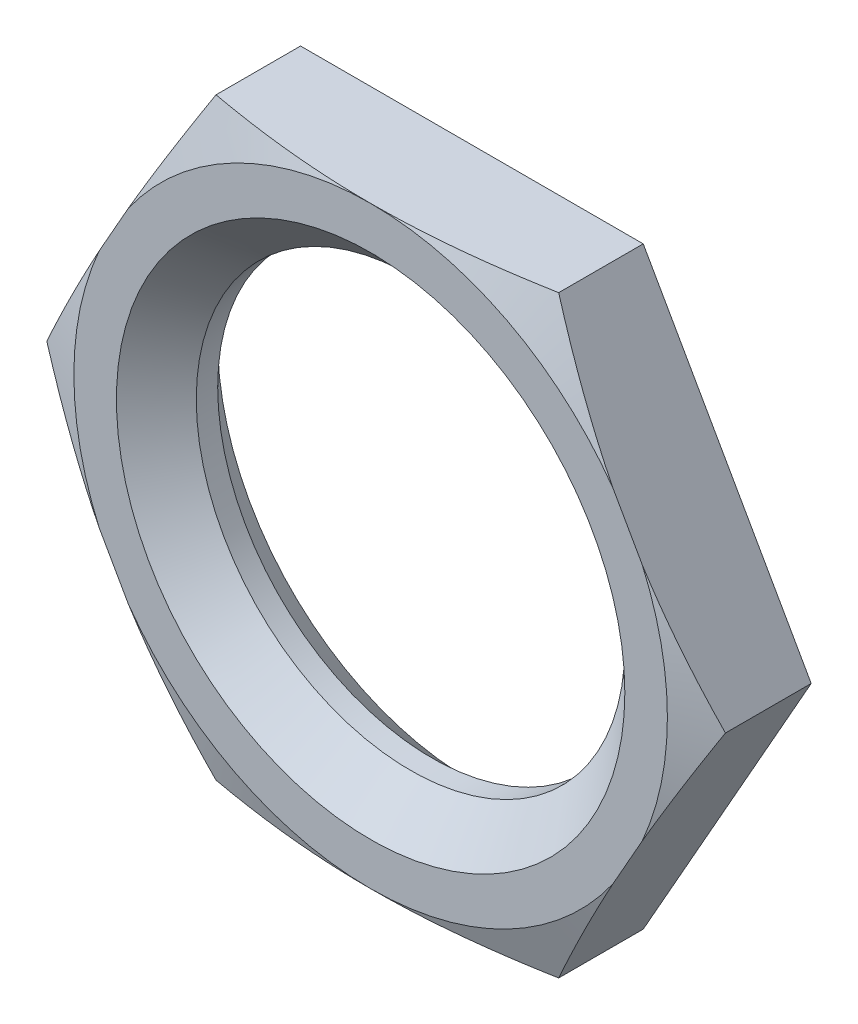
ISO-10303-21;
HEADER;
FILE_DESCRIPTION(('STEP AP214'),'2;1');
FILE_NAME('part.step','',(''),(''),'','','');
FILE_SCHEMA(('AUTOMOTIVE_DESIGN { 1 0 10303 214 1 1 1 1 }'));
ENDSEC;
DATA;
#1=APPLICATION_CONTEXT('core data for automotive mechanical design processes');
#2=APPLICATION_PROTOCOL_DEFINITION('international standard','automotive_design',2000,#1);
#3=PRODUCT_CONTEXT('',#1,'mechanical');
#4=PRODUCT('Part','Part','',(#3));
#5=PRODUCT_RELATED_PRODUCT_CATEGORY('part','',(#4));
#6=PRODUCT_DEFINITION_FORMATION('','',#4);
#7=PRODUCT_DEFINITION_CONTEXT('part definition',#1,'design');
#8=PRODUCT_DEFINITION('design','',#6,#7);
#9=PRODUCT_DEFINITION_SHAPE('','',#8);
#10=(LENGTH_UNIT() NAMED_UNIT(*) SI_UNIT(.MILLI.,.METRE.));
#11=(NAMED_UNIT(*) PLANE_ANGLE_UNIT() SI_UNIT($,.RADIAN.));
#12=(NAMED_UNIT(*) SI_UNIT($,.STERADIAN.) SOLID_ANGLE_UNIT());
#13=UNCERTAINTY_MEASURE_WITH_UNIT(LENGTH_MEASURE(1.E-05),#10,'distance_accuracy_value','');
#14=(GEOMETRIC_REPRESENTATION_CONTEXT(3) GLOBAL_UNCERTAINTY_ASSIGNED_CONTEXT((#13)) GLOBAL_UNIT_ASSIGNED_CONTEXT((#10,
#11,#12)) REPRESENTATION_CONTEXT('',''));
#15=CARTESIAN_POINT('',(0.,0.,0.));
#16=DIRECTION('',(0.,0.,1.));
#17=DIRECTION('',(1.,0.,0.));
#18=AXIS2_PLACEMENT_3D('',#15,#16,#17);
#19=CARTESIAN_POINT('',(0.,8.39724,-1.1938));
#20=DIRECTION('',(0.,0.,1.));
#21=DIRECTION('',(1.,0.,0.));
#22=AXIS2_PLACEMENT_3D('',#19,#20,#21);
#23=PLANE('',#22);
#24=CARTESIAN_POINT('',(0.,0.,-1.1938));
#25=DIRECTION('',(0.,0.,1.));
#26=DIRECTION('',(1.,0.,0.));
#27=AXIS2_PLACEMENT_3D('',#24,#25,#26);
#28=CIRCLE('',#27,5.9944);
#29=CARTESIAN_POINT('',(5.9944,0.,-1.1938));
#30=VERTEX_POINT('',#29);
#31=EDGE_CURVE('E175',#30,#30,#28,.T.);
#32=ORIENTED_EDGE('',*,*,#31,.T.);
#33=EDGE_LOOP('',(#32));
#34=FACE_BOUND('',#33,.T.);
#35=DIRECTION('',(-0.492590096904637,0.870261452916008,0.));
#36=VECTOR('',#35,1.);
#37=CARTESIAN_POINT('',(-9.65934442041346,2.92980560066673,-1.1938));
#38=LINE('',#37,#36);
#39=CARTESIAN_POINT('',(-4.0401239787082,-6.9977,-1.1938));
#40=VERTEX_POINT('',#39);
#41=CARTESIAN_POINT('',(-8.001,0.,-1.1938));
#42=VERTEX_POINT('',#41);
#43=EDGE_CURVE('E42',#40,#42,#38,.T.);
#44=ORIENTED_EDGE('',*,*,#43,.T.);
#45=DIRECTION('',(0.492590096904637,0.870261452916008,0.));
#46=VECTOR('',#45,1.);
#47=CARTESIAN_POINT('',(-2.45985023248309,9.78957773980184,-1.1938));
#48=LINE('',#47,#46);
#49=CARTESIAN_POINT('',(-4.0401239787082,6.9977,-1.1938));
#50=VERTEX_POINT('',#49);
#51=EDGE_CURVE('E11',#42,#50,#48,.T.);
#52=ORIENTED_EDGE('',*,*,#51,.T.);
#53=DIRECTION('',(1.,0.,0.));
#54=VECTOR('',#53,1.);
#55=CARTESIAN_POINT('',(0.,6.9977,-1.1938));
#56=LINE('',#55,#54);
#57=CARTESIAN_POINT('',(4.0401239787082,6.9977,-1.1938));
#58=VERTEX_POINT('',#57);
#59=EDGE_CURVE('E114',#50,#58,#56,.T.);
#60=ORIENTED_EDGE('',*,*,#59,.T.);
#61=DIRECTION('',(0.492590096904637,-0.870261452916008,0.));
#62=VECTOR('',#61,1.);
#63=CARTESIAN_POINT('',(2.45985023248309,9.78957773980184,-1.1938));
#64=LINE('',#63,#62);
#65=CARTESIAN_POINT('',(8.001,0.,-1.1938));
#66=VERTEX_POINT('',#65);
#67=EDGE_CURVE('E118',#58,#66,#64,.T.);
#68=ORIENTED_EDGE('',*,*,#67,.T.);
#69=DIRECTION('',(-0.492590096904637,-0.870261452916008,0.));
#70=VECTOR('',#69,1.);
#71=CARTESIAN_POINT('',(9.65934442041346,2.92980560066673,-1.1938));
#72=LINE('',#71,#70);
#73=CARTESIAN_POINT('',(4.0401239787082,-6.9977,-1.1938));
#74=VERTEX_POINT('',#73);
#75=EDGE_CURVE('E137',#66,#74,#72,.T.);
#76=ORIENTED_EDGE('',*,*,#75,.T.);
#77=DIRECTION('',(-1.,0.,0.));
#78=VECTOR('',#77,1.);
#79=CARTESIAN_POINT('',(0.,-6.9977,-1.1938));
#80=LINE('',#79,#78);
#81=EDGE_CURVE('E133',#74,#40,#80,.T.);
#82=ORIENTED_EDGE('',*,*,#81,.T.);
#83=EDGE_LOOP('',(#44,#52,#60,#68,#76,#82));
#84=FACE_BOUND('',#83,.T.);
#85=ADVANCED_FACE('F34',(#34,#84),#23,.F.);
#86=CARTESIAN_POINT('',(-4.0401239787082,6.9977,2.3876));
#87=DIRECTION('',(0.870261452916008,-0.492590096904637,0.));
#88=DIRECTION('',(0.492590096904637,0.870261452916008,0.));
#89=AXIS2_PLACEMENT_3D('',#86,#87,#88);
#90=PLANE('',#89);
#91=DIRECTION('',(0.,0.,-1.));
#92=VECTOR('',#91,1.);
#93=CARTESIAN_POINT('',(-4.0401239787082,6.9977,2.3876));
#94=LINE('',#93,#92);
#95=CARTESIAN_POINT('',(-4.04012397870823,6.9977,0.799784766334771));
#96=VERTEX_POINT('',#95);
#97=EDGE_CURVE('E49',#96,#50,#94,.T.);
#98=ORIENTED_EDGE('',*,*,#97,.T.);
#99=ORIENTED_EDGE('',*,*,#51,.F.);
#100=DIRECTION('',(0.,0.,-1.));
#101=VECTOR('',#100,1.);
#102=CARTESIAN_POINT('',(-8.001,0.,2.3876));
#103=LINE('',#102,#101);
#104=CARTESIAN_POINT('',(-8.001,0.,0.82862866396072));
#105=VERTEX_POINT('',#104);
#106=EDGE_CURVE('E196',#105,#42,#103,.T.);
#107=ORIENTED_EDGE('',*,*,#106,.F.);
#108=CARTESIAN_POINT('',(-1.3037186274138,11.8321213814872,-0.591848746739535));
#109=CARTESIAN_POINT('',(-1.40466338531494,11.6537817595026,-0.53135656408363));
#110=CARTESIAN_POINT('',(-1.50569517397511,11.4752883798293,-0.471463160661382));
#111=CARTESIAN_POINT('',(-1.70795832769261,11.1179490278374,-0.353064184081212));
#112=CARTESIAN_POINT('',(-1.80918969737085,10.9391030473549,-0.29455864347532));
#113=CARTESIAN_POINT('',(-2.11328198211163,10.4018616468435,-0.121374937183393));
#114=CARTESIAN_POINT('',(-2.31647373561037,10.0428817328511,-0.00907031431873028));
#115=CARTESIAN_POINT('',(-2.72605109391424,9.31927931136751,0.208260491105688));
#116=CARTESIAN_POINT('',(-2.93244800454198,8.95463682982155,0.313199462469798));
#117=CARTESIAN_POINT('',(-3.34658603781928,8.22297704045015,0.511566736184622));
#118=CARTESIAN_POINT('',(-3.55432709053474,7.85595985617765,0.604995632401966));
#119=CARTESIAN_POINT('',(-3.96398110135312,7.13222201230319,0.773410885714152));
#120=CARTESIAN_POINT('',(-4.1658399012386,6.77559703430201,0.848933213706413));
#121=CARTESIAN_POINT('',(-4.5710748837949,6.05966631034327,0.981327931849846));
#122=CARTESIAN_POINT('',(-4.77445099468678,5.70036069119796,1.03820119857615));
#123=CARTESIAN_POINT('',(-5.07993278109211,5.16066445096284,1.10606540736237));
#124=CARTESIAN_POINT('',(-5.18157642437578,4.98109010458525,1.12575172447513));
#125=CARTESIAN_POINT('',(-5.3851062214974,4.62151296718891,1.15894588242107));
#126=CARTESIAN_POINT('',(-5.48699236139948,4.44151020079072,1.17245407007558));
#127=CARTESIAN_POINT('',(-5.69091630313002,4.08123672609043,1.19293757870922));
#128=CARTESIAN_POINT('',(-5.79295409170372,3.90096604120561,1.19991344046484));
#129=CARTESIAN_POINT('',(-5.99708741893258,3.54032264407056,1.20714225246058));
#130=CARTESIAN_POINT('',(-6.09918295713274,3.3599499326242,1.20739525495247));
#131=CARTESIAN_POINT('',(-6.29599478066902,3.01224147364784,1.20139447222335));
#132=CARTESIAN_POINT('',(-6.39071457965748,2.8448995185302,1.19560656091969));
#133=CARTESIAN_POINT('',(-6.58003066675646,2.51043381559703,1.17837639357245));
#134=CARTESIAN_POINT('',(-6.67462694946924,2.3433100773177,1.16693389819946));
#135=CARTESIAN_POINT('',(-6.95812570507759,1.84245137044165,1.12448796214573));
#136=CARTESIAN_POINT('',(-7.14674238316242,1.50922131700419,1.08536592098982));
#137=CARTESIAN_POINT('',(-7.52365831235583,0.843322009997719,0.988335257078691));
#138=CARTESIAN_POINT('',(-7.71195192603743,0.510662716099902,0.930339386996049));
#139=CARTESIAN_POINT('',(-8.08724132258967,-0.152362987339587,0.799255004683489));
#140=CARTESIAN_POINT('',(-8.27423709583033,-0.482729379867918,0.726166380588734));
#141=CARTESIAN_POINT('',(-8.65336985081349,-1.15254516437722,0.565516659240745));
#142=CARTESIAN_POINT('',(-8.845464208145,-1.49191925159248,0.47754641808891));
#143=CARTESIAN_POINT('',(-9.22852328579107,-2.16867169050615,0.292002617469699));
#144=CARTESIAN_POINT('',(-9.41948794762297,-2.50604993888295,0.194428565360407));
#145=CARTESIAN_POINT('',(-9.79873146552542,-3.17606140881037,-0.00710770974171463));
#146=CARTESIAN_POINT('',(-9.98701893266956,-3.5087098435889,-0.111003555889708));
#147=CARTESIAN_POINT('',(-10.2688501275604,-4.00662246238487,-0.270974779406843));
#148=CARTESIAN_POINT('',(-10.3626813307285,-4.17239453070509,-0.324978920105651));
#149=CARTESIAN_POINT('',(-10.550169147457,-4.50363021898923,-0.434209074833027));
#150=CARTESIAN_POINT('',(-10.6438257643353,-4.66909384481514,-0.489435065378169));
#151=CARTESIAN_POINT('',(-10.7374053512944,-4.83442138148716,-0.545194039681704));
#152=B_SPLINE_CURVE_WITH_KNOTS('',3,(#108,#109,#110,#111,#112,#113,#114,#115,#116,#117,#118,
#119,#120,#121,#122,#123,#124,#125,#126,#127,#128,#129,#130,#131,#132,#133,#134,#135,#136,#137,
#138,#139,#140,#141,#142,#143,#144,#145,#146,#147,#148,#149,#150,#151),.UNSPECIFIED.,.F.,.F.,(4,
2,2,2,2,2,2,2,2,2,2,2,2,2,2,2,2,2,2,2,2,4),(0.,0.641003308855448,1.28202163747186,
2.56448608561153,3.86020386979143,5.15585477290437,6.4056192161705,7.65532490744358,
8.2770936416009,8.89882746727437,9.52050981836353,10.1421873375787,10.7192292902208,
11.2962956681679,12.450402285628,13.6099215874383,14.7694494837103,15.9685931823243,
17.1677984249062,18.3560667595874,18.9500418354418,19.5440055052518),.UNSPECIFIED.);
#153=CARTESIAN_POINT('',(-6.40263499073757,2.82383966708149,1.1938));
#154=VERTEX_POINT('',#153);
#155=EDGE_CURVE('E149',#154,#105,#152,.T.);
#156=ORIENTED_EDGE('',*,*,#155,.F.);
#157=DIRECTION('',(-0.492590096904637,-0.870261452916008,0.));
#158=VECTOR('',#157,1.);
#159=CARTESIAN_POINT('',(-6.05959732644828,3.42988606956755,1.1938));
#160=LINE('',#159,#158);
#161=CARTESIAN_POINT('',(-5.71655966215898,4.03593247205362,1.1938));
#162=VERTEX_POINT('',#161);
#163=EDGE_CURVE('E146',#162,#154,#160,.T.);
#164=ORIENTED_EDGE('',*,*,#163,.F.);
#165=EDGE_CURVE('E126',#96,#162,#152,.T.);
#166=ORIENTED_EDGE('',*,*,#165,.F.);
#167=EDGE_LOOP('',(#98,#99,#107,#156,#164,#166));
#168=FACE_BOUND('',#167,.T.);
#169=ADVANCED_FACE('F122',(#168),#90,.F.);
#170=CARTESIAN_POINT('',(-8.001,0.,2.3876));
#171=DIRECTION('',(0.870261452916008,0.492590096904637,0.));
#172=DIRECTION('',(-0.492590096904637,0.870261452916008,0.));
#173=AXIS2_PLACEMENT_3D('',#170,#171,#172);
#174=PLANE('',#173);
#175=ORIENTED_EDGE('',*,*,#106,.T.);
#176=ORIENTED_EDGE('',*,*,#43,.F.);
#177=DIRECTION('',(0.,0.,-1.));
#178=VECTOR('',#177,1.);
#179=CARTESIAN_POINT('',(-4.0401239787082,-6.9977,2.3876));
#180=LINE('',#179,#178);
#181=CARTESIAN_POINT('',(-4.0401239787082,-6.9977,0.799784766334731));
#182=VERTEX_POINT('',#181);
#183=EDGE_CURVE('E194',#182,#40,#180,.T.);
#184=ORIENTED_EDGE('',*,*,#183,.F.);
#185=CARTESIAN_POINT('',(-10.7374053512944,4.83442138148716,-0.545194039681704));
#186=CARTESIAN_POINT('',(-10.6374480293024,4.65782626759235,-0.485635610449754));
#187=CARTESIAN_POINT('',(-10.5374029644708,4.48107613797235,-0.426684331231533));
#188=CARTESIAN_POINT('',(-10.337111849989,4.12722079782149,-0.310188008788266));
#189=CARTESIAN_POINT('',(-10.2368657955033,3.95011557874787,-0.252642999845457));
#190=CARTESIAN_POINT('',(-9.93572595750876,3.41809028105948,-0.0823704558135443));
#191=CARTESIAN_POINT('',(-9.73449944183858,3.06258236282731,0.0279532316964253));
#192=CARTESIAN_POINT('',(-9.32892148311146,2.34604570110691,0.241182146683795));
#193=CARTESIAN_POINT('',(-9.1245589897161,1.98499743492909,0.344001355179305));
#194=CARTESIAN_POINT('',(-8.714496201775,1.26053740241347,0.538039897126236));
#195=CARTESIAN_POINT('',(-8.50879598165309,0.89712576756061,0.629259870189803));
#196=CARTESIAN_POINT('',(-8.10306557009173,0.180319766635345,0.79332334519048));
#197=CARTESIAN_POINT('',(-7.90308809591618,-0.172981463576311,0.866697156993924));
#198=CARTESIAN_POINT('',(-7.50165272705607,-0.882199390512628,0.994806809455336));
#199=CARTESIAN_POINT('',(-7.30019490927662,-1.23811595136866,1.04954361142557));
#200=CARTESIAN_POINT('',(-6.99761747729361,-1.77268105373634,1.11434145753971));
#201=CARTESIAN_POINT('',(-6.89693924271567,-1.95054980759757,1.13303149789113));
#202=CARTESIAN_POINT('',(-6.69535474917001,-2.30669016718005,1.16430254755028));
#203=CARTESIAN_POINT('',(-6.59444850302228,-2.48496175025213,1.17688389213691));
#204=CARTESIAN_POINT('',(-6.39249770529211,-2.8417492613178,1.19561055998983));
#205=CARTESIAN_POINT('',(-6.29145316417773,-3.02026517081742,1.20175634603614));
#206=CARTESIAN_POINT('',(-6.0893189730238,-3.37737668398629,1.20744724076141));
#207=CARTESIAN_POINT('',(-5.98822932323747,-3.5559722872082,1.20699238603701));
#208=CARTESIAN_POINT('',(-5.79142008312431,-3.90367618203769,1.19969100306815));
#209=CARTESIAN_POINT('',(-5.69569741998902,-4.07278990239174,1.19318156983233));
#210=CARTESIAN_POINT('',(-5.50438754731221,-4.41077803654039,1.17441187869781));
#211=CARTESIAN_POINT('',(-5.40880034400402,-4.57965243932252,1.16215136425731));
#212=CARTESIAN_POINT('',(-5.12234657432152,-5.08573178473294,1.11714044569189));
#213=CARTESIAN_POINT('',(-4.93178479610865,-5.42239825655181,1.07616053803107));
#214=CARTESIAN_POINT('',(-4.55100247664977,-6.09512833508841,0.975275268205358));
#215=CARTESIAN_POINT('',(-4.36078784640209,-6.43118149881508,0.915281015991594));
#216=CARTESIAN_POINT('',(-3.98168453637071,-7.10094526277692,0.780185274429952));
#217=CARTESIAN_POINT('',(-3.79279586152307,-7.43465585429153,0.705083728873783));
#218=CARTESIAN_POINT('',(-3.40974111785185,-8.11140063634959,0.540346925601227));
#219=CARTESIAN_POINT('',(-3.21561872640299,-8.4543576618509,0.450298536120221));
#220=CARTESIAN_POINT('',(-2.82850918273495,-9.13826607987866,0.260660755027924));
#221=CARTESIAN_POINT('',(-2.63552208688458,-9.47921737281808,0.161070893844665));
#222=CARTESIAN_POINT('',(-2.25228145235634,-10.1562905692075,-0.0443967154655958));
#223=CARTESIAN_POINT('',(-2.06201916112009,-10.4924279358473,-0.150207582421096));
#224=CARTESIAN_POINT('',(-1.77722280153133,-10.9955791263368,-0.31300547305442));
#225=CARTESIAN_POINT('',(-1.68240249596373,-11.1630986469438,-0.367944286242358));
#226=CARTESIAN_POINT('',(-1.49293550060905,-11.497830960267,-0.479029538958492));
#227=CARTESIAN_POINT('',(-1.39828880763971,-11.6650437586054,-0.535175956106794));
#228=CARTESIAN_POINT('',(-1.3037186274138,-11.8321213814872,-0.591848746739534));
#229=B_SPLINE_CURVE_WITH_KNOTS('',3,(#185,#186,#187,#188,#189,#190,#191,#192,#193,#194,#195,
#196,#197,#198,#199,#200,#201,#202,#203,#204,#205,#206,#207,#208,#209,#210,#211,#212,#213,#214,
#215,#216,#217,#218,#219,#220,#221,#222,#223,#224,#225,#226,#227,#228),.UNSPECIFIED.,.F.,.F.,(4,
2,2,2,2,2,2,2,2,2,2,2,2,2,2,2,2,2,2,2,2,4),(0.,0.634443242607301,1.26890193635587,
2.53825711321435,3.82041151203614,5.10249517882611,6.33982581273893,7.57709261445006,
8.1927301610732,8.80833391429171,9.42389339649788,10.0394494657932,10.622662223508,
11.2059009994028,12.372359987686,13.5443545431876,14.7163534593001,15.9289253689569,
17.1415569845545,18.3429423750248,18.9434787787208,19.5440040625624),.UNSPECIFIED.);
#230=CARTESIAN_POINT('',(-5.71655966215898,-4.03593247205361,1.1938));
#231=VERTEX_POINT('',#230);
#232=EDGE_CURVE('E251',#231,#182,#229,.T.);
#233=ORIENTED_EDGE('',*,*,#232,.F.);
#234=DIRECTION('',(0.492590096904637,-0.870261452916008,0.));
#235=VECTOR('',#234,1.);
#236=CARTESIAN_POINT('',(-6.05959732644828,-3.42988606956755,1.1938));
#237=LINE('',#236,#235);
#238=CARTESIAN_POINT('',(-6.40263499073757,-2.8238396670815,1.1938));
#239=VERTEX_POINT('',#238);
#240=EDGE_CURVE('E158',#239,#231,#237,.T.);
#241=ORIENTED_EDGE('',*,*,#240,.F.);
#242=EDGE_CURVE('E157',#105,#239,#229,.T.);
#243=ORIENTED_EDGE('',*,*,#242,.F.);
#244=EDGE_LOOP('',(#175,#176,#184,#233,#241,#243));
#245=FACE_BOUND('',#244,.T.);
#246=ADVANCED_FACE('F166',(#245),#174,.F.);
#247=CARTESIAN_POINT('',(-4.0401239787082,-6.9977,2.3876));
#248=DIRECTION('',(0.,1.,0.));
#249=DIRECTION('',(0.,0.,1.));
#250=AXIS2_PLACEMENT_3D('',#247,#248,#249);
#251=PLANE('',#250);
#252=ORIENTED_EDGE('',*,*,#183,.T.);
#253=ORIENTED_EDGE('',*,*,#81,.F.);
#254=DIRECTION('',(0.,0.,-1.));
#255=VECTOR('',#254,1.);
#256=CARTESIAN_POINT('',(4.0401239787082,-6.9977,2.3876));
#257=LINE('',#256,#255);
#258=CARTESIAN_POINT('',(4.0401239787082,-6.9977,0.799784766334731));
#259=VERTEX_POINT('',#258);
#260=EDGE_CURVE('E191',#259,#74,#257,.T.);
#261=ORIENTED_EDGE('',*,*,#260,.F.);
#262=CARTESIAN_POINT('',(-10.7078218716367,-6.9977,-0.915010326642584));
#263=CARTESIAN_POINT('',(-10.3911009161172,-6.9977,-0.818539189609649));
#264=CARTESIAN_POINT('',(-10.0740314695785,-6.9977,-0.723191331746901));
#265=CARTESIAN_POINT('',(-9.43901814649866,-6.9977,-0.535363551402579));
#266=CARTESIAN_POINT('',(-9.12107420315141,-6.9977,-0.442883855051296));
#267=CARTESIAN_POINT('',(-8.48359293977712,-6.9977,-0.261260689899761));
#268=CARTESIAN_POINT('',(-8.164053757375,-6.9977,-0.172123734387352));
#269=CARTESIAN_POINT('',(-7.52378826132,-6.9977,0.00177329568066852));
#270=CARTESIAN_POINT('',(-7.20306196901653,-6.9977,0.0865334485442853));
#271=CARTESIAN_POINT('',(-6.5641648829828,-6.9977,0.249583080226079));
#272=CARTESIAN_POINT('',(-6.24601122188613,-6.9977,0.32793935996016));
#273=CARTESIAN_POINT('',(-5.60812198734779,-6.9977,0.4779974014941));
#274=CARTESIAN_POINT('',(-5.28838638741204,-6.9977,0.549699051443058));
#275=CARTESIAN_POINT('',(-4.64725950086119,-6.9977,0.684779831728617));
#276=CARTESIAN_POINT('',(-4.32586880858993,-6.9977,0.748161758900331));
#277=CARTESIAN_POINT('',(-3.68122098788191,-6.9977,0.864676164849298));
#278=CARTESIAN_POINT('',(-3.35796392208751,-6.9977,0.917808985588208));
#279=CARTESIAN_POINT('',(-2.74596063418563,-6.9977,1.00640978097193));
#280=CARTESIAN_POINT('',(-2.45740617892327,-6.9977,1.04319003090771));
#281=CARTESIAN_POINT('',(-1.87907378154689,-6.9977,1.1054870350047));
#282=CARTESIAN_POINT('',(-1.58929587529299,-6.9977,1.13100411701405));
#283=CARTESIAN_POINT('',(-1.0091044976714,-6.9977,1.16954611434048));
#284=CARTESIAN_POINT('',(-0.718691626697289,-6.9977,1.18257992266857));
#285=CARTESIAN_POINT('',(-0.137570478155246,-6.9977,1.19549522696339));
#286=CARTESIAN_POINT('',(0.153137797253476,-6.9977,1.1953768183824));
#287=CARTESIAN_POINT('',(0.735720135031966,-6.9977,1.18196012599631));
#288=CARTESIAN_POINT('',(1.02759263247257,-6.9977,1.16859500225574));
#289=CARTESIAN_POINT('',(1.61048324843488,-6.9977,1.12929975334168));
#290=CARTESIAN_POINT('',(1.90150134622565,-6.9977,1.10336932578051));
#291=CARTESIAN_POINT('',(2.48253860274489,-6.9977,1.0401587959467));
#292=CARTESIAN_POINT('',(2.77255668220848,-6.9977,1.00286891490958));
#293=CARTESIAN_POINT('',(3.35114189987881,-6.9977,0.918455331470847));
#294=CARTESIAN_POINT('',(3.63970903037945,-6.9977,0.871331576897036));
#295=CARTESIAN_POINT('',(4.23109624279693,-6.9977,0.7659826980673));
#296=CARTESIAN_POINT('',(4.53383252752905,-6.9977,0.707291322322115));
#297=CARTESIAN_POINT('',(5.13774676055267,-6.9977,0.582329078476624));
#298=CARTESIAN_POINT('',(5.43892458859408,-6.9977,0.516057634353434));
#299=CARTESIAN_POINT('',(6.03993769894623,-6.9977,0.377333754128046));
#300=CARTESIAN_POINT('',(6.33977256106743,-6.9977,0.304879508771787));
#301=CARTESIAN_POINT('',(6.93817650032606,-6.9977,0.154973400198734));
#302=CARTESIAN_POINT('',(7.23674560787317,-6.9977,0.0775216577800205));
#303=CARTESIAN_POINT('',(7.8331813655467,-6.9977,-0.0815445041134899));
#304=CARTESIAN_POINT('',(8.13104661379691,-6.9977,-0.163164161478948));
#305=CARTESIAN_POINT('',(8.72584680943681,-6.9977,-0.329731729221688));
#306=CARTESIAN_POINT('',(9.02278174300829,-6.9977,-0.414679688784345));
#307=CARTESIAN_POINT('',(9.91229356818082,-6.9977,-0.673559473151436));
#308=CARTESIAN_POINT('',(10.5036864671092,-6.9977,-0.851556771132471));
#309=CARTESIAN_POINT('',(11.6776660799248,-6.9977,-1.21297630875557));
#310=CARTESIAN_POINT('',(12.260278043081,-6.9977,-1.39631720279715));
#311=CARTESIAN_POINT('',(13.4238661256225,-6.9977,-1.76820347819268));
#312=CARTESIAN_POINT('',(14.0048421644276,-6.9977,-1.95674911113905));
#313=CARTESIAN_POINT('',(15.1633290498646,-6.9977,-2.3369154830497));
#314=CARTESIAN_POINT('',(15.7408446596525,-6.9977,-2.52852174217034));
#315=CARTESIAN_POINT('',(16.6063804280772,-6.9977,-2.81805405267359));
#316=CARTESIAN_POINT('',(16.894757755842,-6.9977,-2.91491468082507));
#317=CARTESIAN_POINT('',(17.4713007532099,-6.9977,-3.10926161782266));
#318=CARTESIAN_POINT('',(17.7594664233265,-6.9977,-3.20674792514571));
#319=CARTESIAN_POINT('',(18.04754016785,-6.9977,-3.30450508395375));
#320=B_SPLINE_CURVE_WITH_KNOTS('',3,(#262,#263,#264,#265,#266,#267,#268,#269,#270,#271,#272,
#273,#274,#275,#276,#277,#278,#279,#280,#281,#282,#283,#284,#285,#286,#287,#288,#289,#290,#291,
#292,#293,#294,#295,#296,#297,#298,#299,#300,#301,#302,#303,#304,#305,#306,#307,#308,#309,#310,
#311,#312,#313,#314,#315,#316,#317,#318,#319),.UNSPECIFIED.,.F.,.F.,(4,2,2,2,2,2,2,2,2,2,2,2,2,
2,2,2,2,2,2,2,2,2,2,2,2,2,2,2,4),(0.,0.993269108739945,1.986616330298,2.9818079281676,
3.976981714293,4.95990692200093,5.94284864770763,6.92545908771017,7.90803673722134,
8.78051270253906,9.65296327016377,10.5247918457958,11.3966140941282,12.2728578712726,
13.1491227365244,14.0261440747171,14.9031700659385,15.8281701285378,16.7532405302976,
17.6785825669883,18.6039022449473,19.5304148672248,20.4569411865976,22.309655117059,
24.1419627087728,25.9743590282367,27.7997630594492,28.7123912207313,29.625017161271),.UNSPECIFIED.);
#321=CARTESIAN_POINT('',(0.,-6.9977,1.1938));
#322=VERTEX_POINT('',#321);
#323=EDGE_CURVE('E244',#322,#259,#320,.T.);
#324=ORIENTED_EDGE('',*,*,#323,.F.);
#325=EDGE_CURVE('E250',#182,#322,#320,.T.);
#326=ORIENTED_EDGE('',*,*,#325,.F.);
#327=EDGE_LOOP('',(#252,#253,#261,#324,#326));
#328=FACE_BOUND('',#327,.T.);
#329=ADVANCED_FACE('F227',(#328),#251,.F.);
#330=CARTESIAN_POINT('',(4.0401239787082,-6.9977,2.3876));
#331=DIRECTION('',(-0.870261452916008,0.492590096904637,0.));
#332=DIRECTION('',(-0.492590096904637,-0.870261452916008,0.));
#333=AXIS2_PLACEMENT_3D('',#330,#331,#332);
#334=PLANE('',#333);
#335=ORIENTED_EDGE('',*,*,#260,.T.);
#336=ORIENTED_EDGE('',*,*,#75,.F.);
#337=DIRECTION('',(0.,0.,-1.));
#338=VECTOR('',#337,1.);
#339=CARTESIAN_POINT('',(8.001,0.,2.3876));
#340=LINE('',#339,#338);
#341=CARTESIAN_POINT('',(8.001,0.,0.82862866396072));
#342=VERTEX_POINT('',#341);
#343=EDGE_CURVE('E188',#342,#66,#340,.T.);
#344=ORIENTED_EDGE('',*,*,#343,.F.);
#345=CARTESIAN_POINT('',(1.3037186274138,-11.8321213814872,-0.591848746739535));
#346=CARTESIAN_POINT('',(1.40466338531494,-11.6537817595026,-0.53135656408363));
#347=CARTESIAN_POINT('',(1.50569517397511,-11.4752883798293,-0.471463160661382));
#348=CARTESIAN_POINT('',(1.70795832769261,-11.1179490278374,-0.353064184081212));
#349=CARTESIAN_POINT('',(1.80918969737085,-10.9391030473549,-0.29455864347532));
#350=CARTESIAN_POINT('',(2.11328198211163,-10.4018616468435,-0.121374937183393));
#351=CARTESIAN_POINT('',(2.31647373561037,-10.0428817328511,-0.00907031431873028));
#352=CARTESIAN_POINT('',(2.72605109391424,-9.31927931136751,0.208260491105688));
#353=CARTESIAN_POINT('',(2.93244800454198,-8.95463682982155,0.313199462469798));
#354=CARTESIAN_POINT('',(3.34658603781928,-8.22297704045015,0.511566736184622));
#355=CARTESIAN_POINT('',(3.55432709053474,-7.85595985617765,0.604995632401966));
#356=CARTESIAN_POINT('',(3.96398110135312,-7.13222201230319,0.773410885714152));
#357=CARTESIAN_POINT('',(4.1658399012386,-6.77559703430201,0.848933213706413));
#358=CARTESIAN_POINT('',(4.5710748837949,-6.05966631034327,0.981327931849846));
#359=CARTESIAN_POINT('',(4.77445099468678,-5.70036069119796,1.03820119857615));
#360=CARTESIAN_POINT('',(5.07993278109211,-5.16066445096284,1.10606540736237));
#361=CARTESIAN_POINT('',(5.18157642437578,-4.98109010458525,1.12575172447513));
#362=CARTESIAN_POINT('',(5.3851062214974,-4.62151296718891,1.15894588242107));
#363=CARTESIAN_POINT('',(5.48699236139948,-4.44151020079072,1.17245407007558));
#364=CARTESIAN_POINT('',(5.69091630313002,-4.08123672609043,1.19293757870922));
#365=CARTESIAN_POINT('',(5.79295409170372,-3.90096604120561,1.19991344046484));
#366=CARTESIAN_POINT('',(5.99708741893258,-3.54032264407056,1.20714225246058));
#367=CARTESIAN_POINT('',(6.09918295713274,-3.3599499326242,1.20739525495247));
#368=CARTESIAN_POINT('',(6.29599478066902,-3.01224147364784,1.20139447222335));
#369=CARTESIAN_POINT('',(6.39071457965748,-2.8448995185302,1.19560656091969));
#370=CARTESIAN_POINT('',(6.58003066675646,-2.51043381559703,1.17837639357245));
#371=CARTESIAN_POINT('',(6.67462694946924,-2.3433100773177,1.16693389819946));
#372=CARTESIAN_POINT('',(6.95812570507759,-1.84245137044165,1.12448796214573));
#373=CARTESIAN_POINT('',(7.14674238316242,-1.50922131700419,1.08536592098982));
#374=CARTESIAN_POINT('',(7.52365831235583,-0.843322009997719,0.988335257078691));
#375=CARTESIAN_POINT('',(7.71195192603743,-0.510662716099902,0.930339386996049));
#376=CARTESIAN_POINT('',(8.08724132258967,0.152362987339587,0.799255004683489));
#377=CARTESIAN_POINT('',(8.27423709583033,0.482729379867918,0.726166380588734));
#378=CARTESIAN_POINT('',(8.65336985081349,1.15254516437722,0.565516659240745));
#379=CARTESIAN_POINT('',(8.845464208145,1.49191925159248,0.47754641808891));
#380=CARTESIAN_POINT('',(9.22852328579107,2.16867169050615,0.292002617469699));
#381=CARTESIAN_POINT('',(9.41948794762297,2.50604993888295,0.194428565360407));
#382=CARTESIAN_POINT('',(9.79873146552542,3.17606140881037,-0.00710770974171463));
#383=CARTESIAN_POINT('',(9.98701893266956,3.5087098435889,-0.111003555889708));
#384=CARTESIAN_POINT('',(10.2688501275604,4.00662246238487,-0.270974779406843));
#385=CARTESIAN_POINT('',(10.3626813307285,4.17239453070509,-0.324978920105651));
#386=CARTESIAN_POINT('',(10.550169147457,4.50363021898923,-0.434209074833027));
#387=CARTESIAN_POINT('',(10.6438257643353,4.66909384481514,-0.489435065378169));
#388=CARTESIAN_POINT('',(10.7374053512944,4.83442138148716,-0.545194039681704));
#389=B_SPLINE_CURVE_WITH_KNOTS('',3,(#345,#346,#347,#348,#349,#350,#351,#352,#353,#354,#355,
#356,#357,#358,#359,#360,#361,#362,#363,#364,#365,#366,#367,#368,#369,#370,#371,#372,#373,#374,
#375,#376,#377,#378,#379,#380,#381,#382,#383,#384,#385,#386,#387,#388),.UNSPECIFIED.,.F.,.F.,(4,
2,2,2,2,2,2,2,2,2,2,2,2,2,2,2,2,2,2,2,2,4),(0.,0.641003308855448,1.28202163747186,
2.56448608561153,3.86020386979143,5.15585477290437,6.4056192161705,7.65532490744358,
8.2770936416009,8.89882746727437,9.52050981836353,10.1421873375787,10.7192292902208,
11.2962956681679,12.450402285628,13.6099215874383,14.7694494837103,15.9685931823243,
17.1677984249062,18.3560667595874,18.9500418354418,19.5440055052518),.UNSPECIFIED.);
#390=CARTESIAN_POINT('',(6.40263499073757,-2.82383966708149,1.1938));
#391=VERTEX_POINT('',#390);
#392=EDGE_CURVE('E231',#391,#342,#389,.T.);
#393=ORIENTED_EDGE('',*,*,#392,.F.);
#394=DIRECTION('',(0.492590096904637,0.870261452916008,0.));
#395=VECTOR('',#394,1.);
#396=CARTESIAN_POINT('',(6.05959732644828,-3.42988606956755,1.1938));
#397=LINE('',#396,#395);
#398=CARTESIAN_POINT('',(5.71655966215898,-4.03593247205362,1.1938));
#399=VERTEX_POINT('',#398);
#400=EDGE_CURVE('E238',#399,#391,#397,.T.);
#401=ORIENTED_EDGE('',*,*,#400,.F.);
#402=EDGE_CURVE('E240',#259,#399,#389,.T.);
#403=ORIENTED_EDGE('',*,*,#402,.F.);
#404=EDGE_LOOP('',(#335,#336,#344,#393,#401,#403));
#405=FACE_BOUND('',#404,.T.);
#406=ADVANCED_FACE('F223',(#405),#334,.F.);
#407=CARTESIAN_POINT('',(8.001,0.,2.3876));
#408=DIRECTION('',(-0.870261452916008,-0.492590096904637,0.));
#409=DIRECTION('',(0.492590096904637,-0.870261452916008,0.));
#410=AXIS2_PLACEMENT_3D('',#407,#408,#409);
#411=PLANE('',#410);
#412=ORIENTED_EDGE('',*,*,#343,.T.);
#413=ORIENTED_EDGE('',*,*,#67,.F.);
#414=DIRECTION('',(0.,0.,-1.));
#415=VECTOR('',#414,1.);
#416=CARTESIAN_POINT('',(4.0401239787082,6.9977,2.3876));
#417=LINE('',#416,#415);
#418=CARTESIAN_POINT('',(4.0401239787082,6.9977,0.799784766334731));
#419=VERTEX_POINT('',#418);
#420=EDGE_CURVE('E55',#419,#58,#417,.T.);
#421=ORIENTED_EDGE('',*,*,#420,.F.);
#422=CARTESIAN_POINT('',(10.7374053512944,-4.83442138148716,-0.545194039681704));
#423=CARTESIAN_POINT('',(10.6374480293024,-4.65782626759235,-0.485635610449754));
#424=CARTESIAN_POINT('',(10.5374029644708,-4.48107613797235,-0.426684331231533));
#425=CARTESIAN_POINT('',(10.337111849989,-4.12722079782149,-0.310188008788266));
#426=CARTESIAN_POINT('',(10.2368657955033,-3.95011557874787,-0.252642999845457));
#427=CARTESIAN_POINT('',(9.93572595750876,-3.41809028105948,-0.0823704558135443));
#428=CARTESIAN_POINT('',(9.73449944183858,-3.06258236282731,0.0279532316964253));
#429=CARTESIAN_POINT('',(9.32892148311146,-2.34604570110691,0.241182146683795));
#430=CARTESIAN_POINT('',(9.1245589897161,-1.98499743492909,0.344001355179305));
#431=CARTESIAN_POINT('',(8.714496201775,-1.26053740241347,0.538039897126236));
#432=CARTESIAN_POINT('',(8.50879598165309,-0.89712576756061,0.629259870189803));
#433=CARTESIAN_POINT('',(8.10306557009173,-0.180319766635345,0.79332334519048));
#434=CARTESIAN_POINT('',(7.90308809591618,0.172981463576311,0.866697156993924));
#435=CARTESIAN_POINT('',(7.50165272705607,0.882199390512628,0.994806809455336));
#436=CARTESIAN_POINT('',(7.30019490927662,1.23811595136866,1.04954361142557));
#437=CARTESIAN_POINT('',(6.99761747729361,1.77268105373634,1.11434145753971));
#438=CARTESIAN_POINT('',(6.89693924271567,1.95054980759757,1.13303149789113));
#439=CARTESIAN_POINT('',(6.69535474917001,2.30669016718005,1.16430254755028));
#440=CARTESIAN_POINT('',(6.59444850302228,2.48496175025213,1.17688389213691));
#441=CARTESIAN_POINT('',(6.39249770529211,2.8417492613178,1.19561055998983));
#442=CARTESIAN_POINT('',(6.29145316417773,3.02026517081742,1.20175634603614));
#443=CARTESIAN_POINT('',(6.0893189730238,3.37737668398629,1.20744724076141));
#444=CARTESIAN_POINT('',(5.98822932323747,3.5559722872082,1.20699238603701));
#445=CARTESIAN_POINT('',(5.79142008312431,3.90367618203769,1.19969100306815));
#446=CARTESIAN_POINT('',(5.69569741998902,4.07278990239174,1.19318156983233));
#447=CARTESIAN_POINT('',(5.50438754731221,4.41077803654039,1.17441187869781));
#448=CARTESIAN_POINT('',(5.40880034400402,4.57965243932252,1.16215136425731));
#449=CARTESIAN_POINT('',(5.12234657432152,5.08573178473294,1.11714044569189));
#450=CARTESIAN_POINT('',(4.93178479610865,5.42239825655181,1.07616053803107));
#451=CARTESIAN_POINT('',(4.55100247664977,6.09512833508841,0.975275268205358));
#452=CARTESIAN_POINT('',(4.36078784640209,6.43118149881508,0.915281015991594));
#453=CARTESIAN_POINT('',(3.98168453637071,7.10094526277692,0.780185274429952));
#454=CARTESIAN_POINT('',(3.79279586152307,7.43465585429153,0.705083728873783));
#455=CARTESIAN_POINT('',(3.40974111785185,8.11140063634959,0.540346925601227));
#456=CARTESIAN_POINT('',(3.21561872640299,8.4543576618509,0.450298536120221));
#457=CARTESIAN_POINT('',(2.82850918273495,9.13826607987866,0.260660755027924));
#458=CARTESIAN_POINT('',(2.63552208688458,9.47921737281808,0.161070893844665));
#459=CARTESIAN_POINT('',(2.25228145235634,10.1562905692075,-0.0443967154655958));
#460=CARTESIAN_POINT('',(2.06201916112009,10.4924279358473,-0.150207582421096));
#461=CARTESIAN_POINT('',(1.77722280153133,10.9955791263368,-0.31300547305442));
#462=CARTESIAN_POINT('',(1.68240249596373,11.1630986469438,-0.367944286242358));
#463=CARTESIAN_POINT('',(1.49293550060905,11.497830960267,-0.479029538958492));
#464=CARTESIAN_POINT('',(1.39828880763971,11.6650437586054,-0.535175956106794));
#465=CARTESIAN_POINT('',(1.3037186274138,11.8321213814872,-0.591848746739534));
#466=B_SPLINE_CURVE_WITH_KNOTS('',3,(#422,#423,#424,#425,#426,#427,#428,#429,#430,#431,#432,
#433,#434,#435,#436,#437,#438,#439,#440,#441,#442,#443,#444,#445,#446,#447,#448,#449,#450,#451,
#452,#453,#454,#455,#456,#457,#458,#459,#460,#461,#462,#463,#464,#465),.UNSPECIFIED.,.F.,.F.,(4,
2,2,2,2,2,2,2,2,2,2,2,2,2,2,2,2,2,2,2,2,4),(0.,0.634443242607301,1.26890193635587,
2.53825711321435,3.82041151203614,5.10249517882611,6.33982581273893,7.57709261445006,
8.1927301610732,8.80833391429171,9.42389339649788,10.0394494657932,10.622662223508,
11.2059009994028,12.372359987686,13.5443545431876,14.7163534593001,15.9289253689569,
17.1415569845545,18.3429423750248,18.9434787787208,19.5440040625624),.UNSPECIFIED.);
#467=CARTESIAN_POINT('',(5.71655966215898,4.03593247205361,1.1938));
#468=VERTEX_POINT('',#467);
#469=EDGE_CURVE('E206',#468,#419,#466,.T.);
#470=ORIENTED_EDGE('',*,*,#469,.F.);
#471=DIRECTION('',(-0.492590096904637,0.870261452916008,0.));
#472=VECTOR('',#471,1.);
#473=CARTESIAN_POINT('',(6.05959732644828,3.42988606956755,1.1938));
#474=LINE('',#473,#472);
#475=CARTESIAN_POINT('',(6.40263499073757,2.8238396670815,1.1938));
#476=VERTEX_POINT('',#475);
#477=EDGE_CURVE('E241',#476,#468,#474,.T.);
#478=ORIENTED_EDGE('',*,*,#477,.F.);
#479=EDGE_CURVE('E239',#342,#476,#466,.T.);
#480=ORIENTED_EDGE('',*,*,#479,.F.);
#481=EDGE_LOOP('',(#412,#413,#421,#470,#478,#480));
#482=FACE_BOUND('',#481,.T.);
#483=ADVANCED_FACE('F217',(#482),#411,.F.);
#484=CARTESIAN_POINT('',(4.0401239787082,6.9977,2.3876));
#485=DIRECTION('',(0.,-1.,0.));
#486=DIRECTION('',(0.,0.,-1.));
#487=AXIS2_PLACEMENT_3D('',#484,#485,#486);
#488=PLANE('',#487);
#489=ORIENTED_EDGE('',*,*,#420,.T.);
#490=ORIENTED_EDGE('',*,*,#59,.F.);
#491=ORIENTED_EDGE('',*,*,#97,.F.);
#492=CARTESIAN_POINT('',(-10.7078218716367,6.9977,-0.915010326642583));
#493=CARTESIAN_POINT('',(-10.3911009161172,6.9977,-0.818539189609649));
#494=CARTESIAN_POINT('',(-10.0740314695785,6.9977,-0.723191331746901));
#495=CARTESIAN_POINT('',(-9.43901814649866,6.9977,-0.535363551402578));
#496=CARTESIAN_POINT('',(-9.1210742031514,6.9977,-0.442883855051294));
#497=CARTESIAN_POINT('',(-8.48359293977711,6.9977,-0.261260689899759));
#498=CARTESIAN_POINT('',(-8.164053757375,6.9977,-0.17212373438735));
#499=CARTESIAN_POINT('',(-7.52378826132,6.9977,0.00177329568067082));
#500=CARTESIAN_POINT('',(-7.20306196901652,6.9977,0.0865334485442875));
#501=CARTESIAN_POINT('',(-6.5641648829828,6.9977,0.249583080226081));
#502=CARTESIAN_POINT('',(-6.24601122188612,6.9977,0.327939359960161));
#503=CARTESIAN_POINT('',(-5.60812198734779,6.9977,0.477997401494101));
#504=CARTESIAN_POINT('',(-5.28838638741204,6.9977,0.549699051443059));
#505=CARTESIAN_POINT('',(-4.64725950086119,6.9977,0.684779831728618));
#506=CARTESIAN_POINT('',(-4.32586880858992,6.9977,0.748161758900332));
#507=CARTESIAN_POINT('',(-3.6812209878819,6.9977,0.864676164849298));
#508=CARTESIAN_POINT('',(-3.35796392208751,6.9977,0.917808985588208));
#509=CARTESIAN_POINT('',(-2.74596063418563,6.9977,1.00640978097193));
#510=CARTESIAN_POINT('',(-2.45740617892327,6.9977,1.04319003090771));
#511=CARTESIAN_POINT('',(-1.87907378154689,6.9977,1.1054870350047));
#512=CARTESIAN_POINT('',(-1.58929587529299,6.9977,1.13100411701405));
#513=CARTESIAN_POINT('',(-1.0091044976714,6.9977,1.16954611434048));
#514=CARTESIAN_POINT('',(-0.718691626697289,6.9977,1.18257992266857));
#515=CARTESIAN_POINT('',(-0.137570478155247,6.9977,1.19549522696339));
#516=CARTESIAN_POINT('',(0.153137797253475,6.9977,1.1953768183824));
#517=CARTESIAN_POINT('',(0.735720135031966,6.9977,1.18196012599631));
#518=CARTESIAN_POINT('',(1.02759263247257,6.9977,1.16859500225574));
#519=CARTESIAN_POINT('',(1.61048324843488,6.9977,1.12929975334168));
#520=CARTESIAN_POINT('',(1.90150134622565,6.9977,1.10336932578051));
#521=CARTESIAN_POINT('',(2.48253860274489,6.9977,1.0401587959467));
#522=CARTESIAN_POINT('',(2.77255668220848,6.9977,1.00286891490958));
#523=CARTESIAN_POINT('',(3.35114189987881,6.9977,0.918455331470847));
#524=CARTESIAN_POINT('',(3.63970903037945,6.9977,0.871331576897036));
#525=CARTESIAN_POINT('',(4.23109624279693,6.9977,0.7659826980673));
#526=CARTESIAN_POINT('',(4.53383252752905,6.9977,0.707291322322115));
#527=CARTESIAN_POINT('',(5.13774676055267,6.9977,0.582329078476624));
#528=CARTESIAN_POINT('',(5.43892458859409,6.9977,0.516057634353434));
#529=CARTESIAN_POINT('',(6.03993769894623,6.9977,0.377333754128046));
#530=CARTESIAN_POINT('',(6.33977256106744,6.9977,0.304879508771786));
#531=CARTESIAN_POINT('',(6.93817650032606,6.9977,0.154973400198733));
#532=CARTESIAN_POINT('',(7.23674560787317,6.9977,0.0775216577800187));
#533=CARTESIAN_POINT('',(7.8331813655467,6.9977,-0.0815445041134906));
#534=CARTESIAN_POINT('',(8.13104661379691,6.9977,-0.163164161478948));
#535=CARTESIAN_POINT('',(8.7258468094368,6.9977,-0.329731729221687));
#536=CARTESIAN_POINT('',(9.02278174300829,6.9977,-0.414679688784344));
#537=CARTESIAN_POINT('',(9.91229356818083,6.9977,-0.673559473151437));
#538=CARTESIAN_POINT('',(10.5036864671092,6.9977,-0.851556771132473));
#539=CARTESIAN_POINT('',(11.6776660799248,6.9977,-1.21297630875557));
#540=CARTESIAN_POINT('',(12.260278043081,6.9977,-1.39631720279715));
#541=CARTESIAN_POINT('',(13.4238661256225,6.9977,-1.76820347819268));
#542=CARTESIAN_POINT('',(14.0048421644276,6.9977,-1.95674911113906));
#543=CARTESIAN_POINT('',(15.1633290498646,6.9977,-2.3369154830497));
#544=CARTESIAN_POINT('',(15.7408446596525,6.9977,-2.52852174217034));
#545=CARTESIAN_POINT('',(16.6063804280772,6.9977,-2.81805405267359));
#546=CARTESIAN_POINT('',(16.894757755842,6.9977,-2.91491468082507));
#547=CARTESIAN_POINT('',(17.4713007532099,6.9977,-3.10926161782267));
#548=CARTESIAN_POINT('',(17.7594664233265,6.9977,-3.20674792514571));
#549=CARTESIAN_POINT('',(18.04754016785,6.9977,-3.30450508395375));
#550=B_SPLINE_CURVE_WITH_KNOTS('',3,(#492,#493,#494,#495,#496,#497,#498,#499,#500,#501,#502,
#503,#504,#505,#506,#507,#508,#509,#510,#511,#512,#513,#514,#515,#516,#517,#518,#519,#520,#521,
#522,#523,#524,#525,#526,#527,#528,#529,#530,#531,#532,#533,#534,#535,#536,#537,#538,#539,#540,
#541,#542,#543,#544,#545,#546,#547,#548,#549),.UNSPECIFIED.,.F.,.F.,(4,2,2,2,2,2,2,2,2,2,2,2,2,
2,2,2,2,2,2,2,2,2,2,2,2,2,2,2,4),(0.,0.993269108739945,1.98661633029801,2.98180792816761,
3.976981714293,4.95990692200093,5.94284864770763,6.92545908771017,7.90803673722134,
8.78051270253906,9.65296327016376,10.5247918457958,11.3966140941282,12.2728578712726,
13.1491227365244,14.0261440747171,14.9031700659385,15.8281701285378,16.7532405302976,
17.6785825669883,18.6039022449473,19.5304148672248,20.4569411865976,22.309655117059,
24.1419627087728,25.9743590282367,27.7997630594492,28.7123912207313,29.6250171612709),.UNSPECIFIED.);
#551=CARTESIAN_POINT('',(0.,6.9977,1.1938));
#552=VERTEX_POINT('',#551);
#553=EDGE_CURVE('E198',#552,#96,#550,.F.);
#554=ORIENTED_EDGE('',*,*,#553,.F.);
#555=EDGE_CURVE('E205',#419,#552,#550,.F.);
#556=ORIENTED_EDGE('',*,*,#555,.F.);
#557=EDGE_LOOP('',(#489,#490,#491,#554,#556));
#558=FACE_BOUND('',#557,.T.);
#559=ADVANCED_FACE('F115',(#558),#488,.F.);
#560=CARTESIAN_POINT('',(0.,0.,0.68440909833508));
#561=DIRECTION('',(0.,0.,-1.));
#562=DIRECTION('',(-1.,0.,0.));
#563=AXIS2_PLACEMENT_3D('',#560,#561,#562);
#564=CONICAL_SURFACE('',#563,8.39724,1.22173047639603);
#565=CARTESIAN_POINT('',(0.,0.,1.1938));
#566=DIRECTION('',(0.,0.,1.));
#567=DIRECTION('',(1.,0.,0.));
#568=AXIS2_PLACEMENT_3D('',#565,#566,#567);
#569=CIRCLE('',#568,6.9977);
#570=EDGE_CURVE('E265',#154,#239,#569,.T.);
#571=ORIENTED_EDGE('',*,*,#570,.F.);
#572=ORIENTED_EDGE('',*,*,#155,.T.);
#573=ORIENTED_EDGE('',*,*,#242,.T.);
#574=EDGE_LOOP('',(#571,#572,#573));
#575=FACE_BOUND('',#574,.T.);
#576=ADVANCED_FACE('F216',(#575),#564,.T.);
#577=EDGE_CURVE('E270',#231,#322,#569,.T.);
#578=ORIENTED_EDGE('',*,*,#577,.F.);
#579=ORIENTED_EDGE('',*,*,#232,.T.);
#580=ORIENTED_EDGE('',*,*,#325,.T.);
#581=EDGE_LOOP('',(#578,#579,#580));
#582=FACE_BOUND('',#581,.T.);
#583=ADVANCED_FACE('F303',(#582),#564,.T.);
#584=EDGE_CURVE('E145',#322,#399,#569,.T.);
#585=ORIENTED_EDGE('',*,*,#584,.F.);
#586=ORIENTED_EDGE('',*,*,#323,.T.);
#587=ORIENTED_EDGE('',*,*,#402,.T.);
#588=EDGE_LOOP('',(#585,#586,#587));
#589=FACE_BOUND('',#588,.T.);
#590=ADVANCED_FACE('F276',(#589),#564,.T.);
#591=EDGE_CURVE('E142',#391,#476,#569,.T.);
#592=ORIENTED_EDGE('',*,*,#591,.F.);
#593=ORIENTED_EDGE('',*,*,#392,.T.);
#594=ORIENTED_EDGE('',*,*,#479,.T.);
#595=EDGE_LOOP('',(#592,#593,#594));
#596=FACE_BOUND('',#595,.T.);
#597=ADVANCED_FACE('F314',(#596),#564,.T.);
#598=ORIENTED_EDGE('',*,*,#553,.T.);
#599=ORIENTED_EDGE('',*,*,#165,.T.);
#600=EDGE_CURVE('E269',#552,#162,#569,.T.);
#601=ORIENTED_EDGE('',*,*,#600,.F.);
#602=EDGE_LOOP('',(#598,#599,#601));
#603=FACE_BOUND('',#602,.T.);
#604=ADVANCED_FACE('F320',(#603),#564,.T.);
#605=CARTESIAN_POINT('',(0.,0.,1.1938));
#606=DIRECTION('',(0.,0.,-1.));
#607=DIRECTION('',(-1.,0.,0.));
#608=AXIS2_PLACEMENT_3D('',#605,#606,#607);
#609=PLANE('',#608);
#610=CARTESIAN_POINT('',(0.,0.,1.1938));
#611=DIRECTION('',(0.,0.,1.));
#612=DIRECTION('',(1.,0.,0.));
#613=AXIS2_PLACEMENT_3D('',#610,#611,#612);
#614=CIRCLE('',#613,5.9944);
#615=CARTESIAN_POINT('',(5.9944,0.,1.1938));
#616=VERTEX_POINT('',#615);
#617=EDGE_CURVE('E128',#616,#616,#614,.T.);
#618=ORIENTED_EDGE('',*,*,#617,.F.);
#619=EDGE_LOOP('',(#618));
#620=FACE_BOUND('',#619,.T.);
#621=ORIENTED_EDGE('',*,*,#600,.T.);
#622=ORIENTED_EDGE('',*,*,#163,.T.);
#623=ORIENTED_EDGE('',*,*,#570,.T.);
#624=ORIENTED_EDGE('',*,*,#240,.T.);
#625=ORIENTED_EDGE('',*,*,#577,.T.);
#626=ORIENTED_EDGE('',*,*,#584,.T.);
#627=ORIENTED_EDGE('',*,*,#400,.T.);
#628=ORIENTED_EDGE('',*,*,#591,.T.);
#629=ORIENTED_EDGE('',*,*,#477,.T.);
#630=EDGE_CURVE('E119',#468,#552,#569,.T.);
#631=ORIENTED_EDGE('',*,*,#630,.T.);
#632=EDGE_LOOP('',(#621,#622,#623,#624,#625,#626,#627,#628,#629,#631));
#633=FACE_BOUND('',#632,.T.);
#634=ADVANCED_FACE('F36',(#620,#633),#609,.F.);
#635=ORIENTED_EDGE('',*,*,#630,.F.);
#636=ORIENTED_EDGE('',*,*,#469,.T.);
#637=ORIENTED_EDGE('',*,*,#555,.T.);
#638=EDGE_LOOP('',(#635,#636,#637));
#639=FACE_BOUND('',#638,.T.);
#640=ADVANCED_FACE('F160',(#639),#564,.T.);
#641=CARTESIAN_POINT('',(0.,0.,0.2524));
#642=DIRECTION('',(0.,0.,1.));
#643=DIRECTION('',(1.,0.,0.));
#644=AXIS2_PLACEMENT_3D('',#641,#642,#643);
#645=CONICAL_SURFACE('',#644,5.053,0.785398163397448);
#646=ORIENTED_EDGE('',*,*,#617,.T.);
#647=EDGE_LOOP('',(#646));
#648=FACE_BOUND('',#647,.T.);
#649=CARTESIAN_POINT('',(0.,0.,0.2524));
#650=DIRECTION('',(0.,0.,1.));
#651=DIRECTION('',(1.,0.,0.));
#652=AXIS2_PLACEMENT_3D('',#649,#650,#651);
#653=CIRCLE('',#652,5.053);
#654=CARTESIAN_POINT('',(5.053,0.,0.2524));
#655=VERTEX_POINT('',#654);
#656=EDGE_CURVE('E180',#655,#655,#653,.T.);
#657=ORIENTED_EDGE('',*,*,#656,.F.);
#658=EDGE_LOOP('',(#657));
#659=FACE_BOUND('',#658,.T.);
#660=ADVANCED_FACE('F218',(#648,#659),#645,.F.);
#661=CARTESIAN_POINT('',(0.,0.,-1.1938));
#662=DIRECTION('',(0.,0.,1.));
#663=DIRECTION('',(1.,0.,0.));
#664=AXIS2_PLACEMENT_3D('',#661,#662,#663);
#665=CYLINDRICAL_SURFACE('',#664,5.053);
#666=ORIENTED_EDGE('',*,*,#656,.T.);
#667=EDGE_LOOP('',(#666));
#668=FACE_BOUND('',#667,.T.);
#669=CARTESIAN_POINT('',(0.,0.,-0.2524));
#670=DIRECTION('',(0.,0.,1.));
#671=DIRECTION('',(1.,0.,0.));
#672=AXIS2_PLACEMENT_3D('',#669,#670,#671);
#673=CIRCLE('',#672,5.053);
#674=CARTESIAN_POINT('',(5.053,0.,-0.2524));
#675=VERTEX_POINT('',#674);
#676=EDGE_CURVE('E177',#675,#675,#673,.T.);
#677=ORIENTED_EDGE('',*,*,#676,.F.);
#678=EDGE_LOOP('',(#677));
#679=FACE_BOUND('',#678,.T.);
#680=ADVANCED_FACE('F345',(#668,#679),#665,.F.);
#681=CARTESIAN_POINT('',(0.,0.,-1.1938));
#682=DIRECTION('',(0.,0.,-1.));
#683=DIRECTION('',(-1.,0.,0.));
#684=AXIS2_PLACEMENT_3D('',#681,#682,#683);
#685=CONICAL_SURFACE('',#684,5.9944,0.785398163397448);
#686=ORIENTED_EDGE('',*,*,#676,.T.);
#687=EDGE_LOOP('',(#686));
#688=FACE_BOUND('',#687,.T.);
#689=ORIENTED_EDGE('',*,*,#31,.F.);
#690=EDGE_LOOP('',(#689));
#691=FACE_BOUND('',#690,.T.);
#692=ADVANCED_FACE('F352',(#688,#691),#685,.F.);
#693=CLOSED_SHELL('',(#85,#169,#246,#329,#406,#483,#559,#576,#583,#590,#597,#604,#634,#640,#660,
#680,#692));
#694=MANIFOLD_SOLID_BREP('B2',#693);
#695=ADVANCED_BREP_SHAPE_REPRESENTATION('',(#18,#694),#14);
#696=SHAPE_DEFINITION_REPRESENTATION(#9,#695);
ENDSEC;
END-ISO-10303-21;
